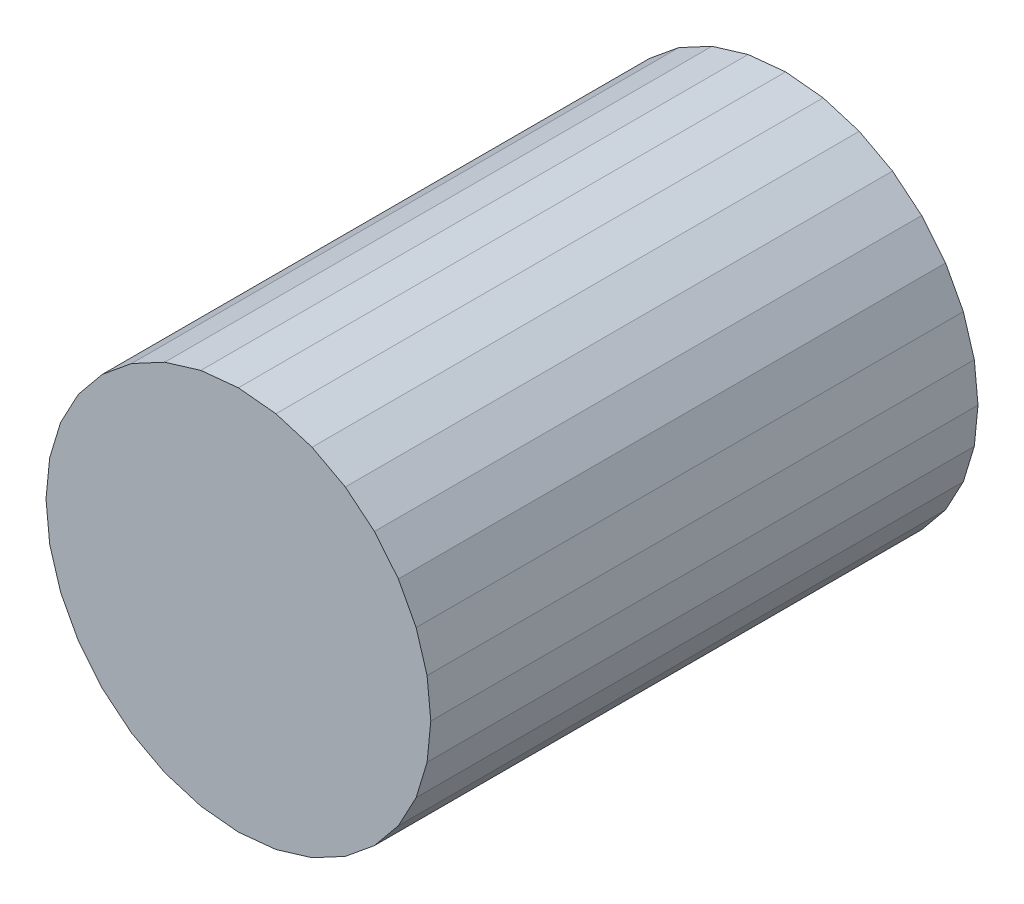
ISO-10303-21;
HEADER;
FILE_DESCRIPTION(('STEP AP214'),'2;1');
FILE_NAME('part.step','',(''),(''),'','','');
FILE_SCHEMA(('AUTOMOTIVE_DESIGN { 1 0 10303 214 1 1 1 1 }'));
ENDSEC;
DATA;
#1=APPLICATION_CONTEXT('core data for automotive mechanical design processes');
#2=APPLICATION_PROTOCOL_DEFINITION('international standard','automotive_design',2000,#1);
#3=PRODUCT_CONTEXT('',#1,'mechanical');
#4=PRODUCT('Part','Part','',(#3));
#5=PRODUCT_RELATED_PRODUCT_CATEGORY('part','',(#4));
#6=PRODUCT_DEFINITION_FORMATION('','',#4);
#7=PRODUCT_DEFINITION_CONTEXT('part definition',#1,'design');
#8=PRODUCT_DEFINITION('design','',#6,#7);
#9=PRODUCT_DEFINITION_SHAPE('','',#8);
#10=(LENGTH_UNIT() NAMED_UNIT(*) SI_UNIT(.MILLI.,.METRE.));
#11=(NAMED_UNIT(*) PLANE_ANGLE_UNIT() SI_UNIT($,.RADIAN.));
#12=(NAMED_UNIT(*) SI_UNIT($,.STERADIAN.) SOLID_ANGLE_UNIT());
#13=UNCERTAINTY_MEASURE_WITH_UNIT(LENGTH_MEASURE(1.E-05),#10,'distance_accuracy_value','');
#14=(GEOMETRIC_REPRESENTATION_CONTEXT(3) GLOBAL_UNCERTAINTY_ASSIGNED_CONTEXT((#13)) GLOBAL_UNIT_ASSIGNED_CONTEXT((#10,
#11,#12)) REPRESENTATION_CONTEXT('',''));
#15=CARTESIAN_POINT('',(0.,0.,0.));
#16=DIRECTION('',(0.,0.,1.));
#17=DIRECTION('',(1.,0.,0.));
#18=AXIS2_PLACEMENT_3D('',#15,#16,#17);
#19=CARTESIAN_POINT('',(0.,1.75795686,0.));
#20=DIRECTION('',(0.098019306513244,0.995184513319346,0.));
#21=DIRECTION('',(-0.995184513319346,0.098019306513244,0.));
#22=AXIS2_PLACEMENT_3D('',#19,#20,#21);
#23=PLANE('',#22);
#24=DIRECTION('',(0.,0.,1.));
#25=VECTOR('',#24,1.);
#26=CARTESIAN_POINT('',(0.34296096,1.7241774,0.));
#27=LINE('',#26,#25);
#28=CARTESIAN_POINT('',(0.342960959999999,1.72417739999999,0.));
#29=VERTEX_POINT('',#28);
#30=CARTESIAN_POINT('',(0.342960959999999,1.72417739999999,5.));
#31=VERTEX_POINT('',#30);
#32=EDGE_CURVE('E227',#29,#31,#27,.T.);
#33=ORIENTED_EDGE('',*,*,#32,.F.);
#34=DIRECTION('',(-0.995184513319346,0.098019306513244,0.));
#35=VECTOR('',#34,1.);
#36=CARTESIAN_POINT('',(0.,1.75795686,0.));
#37=LINE('',#36,#35);
#38=CARTESIAN_POINT('',(0.,1.75795686000001,0.));
#39=VERTEX_POINT('',#38);
#40=EDGE_CURVE('E220',#29,#39,#37,.T.);
#41=ORIENTED_EDGE('',*,*,#40,.T.);
#42=DIRECTION('',(0.,0.,1.));
#43=VECTOR('',#42,1.);
#44=CARTESIAN_POINT('',(0.,1.75795686000003,0.));
#45=LINE('',#44,#43);
#46=CARTESIAN_POINT('',(0.,1.75795686000001,5.));
#47=VERTEX_POINT('',#46);
#48=EDGE_CURVE('E230',#47,#39,#45,.F.);
#49=ORIENTED_EDGE('',*,*,#48,.F.);
#50=DIRECTION('',(-0.995184513319346,0.098019306513244,0.));
#51=VECTOR('',#50,1.);
#52=CARTESIAN_POINT('',(0.,1.75795686,5.));
#53=LINE('',#52,#51);
#54=EDGE_CURVE('E19',#47,#31,#53,.F.);
#55=ORIENTED_EDGE('',*,*,#54,.T.);
#56=EDGE_LOOP('',(#33,#41,#49,#55));
#57=FACE_BOUND('',#56,.T.);
#58=ADVANCED_FACE('F16',(#57),#23,.T.);
#59=CARTESIAN_POINT('',(0.34296096,1.7241774,0.));
#60=DIRECTION('',(0.290284564767888,0.956940369854631,0.));
#61=DIRECTION('',(-0.956940369854631,0.290284564767888,0.));
#62=AXIS2_PLACEMENT_3D('',#59,#60,#61);
#63=PLANE('',#62);
#64=DIRECTION('',(0.,0.,1.));
#65=VECTOR('',#64,1.);
#66=CARTESIAN_POINT('',(0.67274186,1.6241395,0.));
#67=LINE('',#66,#65);
#68=CARTESIAN_POINT('',(0.672741860000032,1.6241395000001,0.));
#69=VERTEX_POINT('',#68);
#70=CARTESIAN_POINT('',(0.672741860000032,1.6241395000001,5.));
#71=VERTEX_POINT('',#70);
#72=EDGE_CURVE('E251',#69,#71,#67,.T.);
#73=ORIENTED_EDGE('',*,*,#72,.F.);
#74=DIRECTION('',(-0.956940369854631,0.290284564767888,0.));
#75=VECTOR('',#74,1.);
#76=CARTESIAN_POINT('',(0.34296096,1.7241774,0.));
#77=LINE('',#76,#75);
#78=EDGE_CURVE('E240',#69,#29,#77,.T.);
#79=ORIENTED_EDGE('',*,*,#78,.T.);
#80=ORIENTED_EDGE('',*,*,#32,.T.);
#81=DIRECTION('',(-0.956940369854631,0.290284564767888,0.));
#82=VECTOR('',#81,1.);
#83=CARTESIAN_POINT('',(0.34296096,1.7241774,5.));
#84=LINE('',#83,#82);
#85=EDGE_CURVE('E233',#31,#71,#84,.F.);
#86=ORIENTED_EDGE('',*,*,#85,.T.);
#87=EDGE_LOOP('',(#73,#79,#80,#86));
#88=FACE_BOUND('',#87,.T.);
#89=ADVANCED_FACE('F242',(#88),#63,.T.);
#90=CARTESIAN_POINT('',(-0.34296096,1.7241774,0.));
#91=DIRECTION('',(-0.098019306513244,0.995184513319346,0.));
#92=DIRECTION('',(-0.995184513319346,-0.098019306513244,0.));
#93=AXIS2_PLACEMENT_3D('',#90,#91,#92);
#94=PLANE('',#93);
#95=ORIENTED_EDGE('',*,*,#48,.T.);
#96=DIRECTION('',(-0.995184513319346,-0.098019306513244,0.));
#97=VECTOR('',#96,1.);
#98=CARTESIAN_POINT('',(-0.34296096,1.7241774,0.));
#99=LINE('',#98,#97);
#100=CARTESIAN_POINT('',(-0.342960959999983,1.72417739999995,0.));
#101=VERTEX_POINT('',#100);
#102=EDGE_CURVE('E249',#39,#101,#99,.T.);
#103=ORIENTED_EDGE('',*,*,#102,.T.);
#104=DIRECTION('',(0.,0.,1.));
#105=VECTOR('',#104,1.);
#106=CARTESIAN_POINT('',(-0.342960959999937,1.72417739999979,0.));
#107=LINE('',#106,#105);
#108=CARTESIAN_POINT('',(-0.342960959999983,1.72417739999995,5.));
#109=VERTEX_POINT('',#108);
#110=EDGE_CURVE('E260',#109,#101,#107,.F.);
#111=ORIENTED_EDGE('',*,*,#110,.F.);
#112=DIRECTION('',(-0.995184513319346,-0.098019306513244,0.));
#113=VECTOR('',#112,1.);
#114=CARTESIAN_POINT('',(-0.34296096,1.7241774,5.));
#115=LINE('',#114,#113);
#116=EDGE_CURVE('E246',#109,#47,#115,.F.);
#117=ORIENTED_EDGE('',*,*,#116,.T.);
#118=EDGE_LOOP('',(#95,#103,#111,#117));
#119=FACE_BOUND('',#118,.T.);
#120=ADVANCED_FACE('F541',(#119),#94,.T.);
#121=CARTESIAN_POINT('',(0.67274186,1.6241395,0.));
#122=DIRECTION('',(0.471394074101923,0.881922687598857,0.));
#123=DIRECTION('',(-0.881922687598857,0.471394074101923,0.));
#124=AXIS2_PLACEMENT_3D('',#121,#122,#123);
#125=PLANE('',#124);
#126=DIRECTION('',(0.,0.,1.));
#127=VECTOR('',#126,1.);
#128=CARTESIAN_POINT('',(0.9766681,1.46168872,0.));
#129=LINE('',#128,#127);
#130=CARTESIAN_POINT('',(0.976668100000013,1.46168872000002,0.));
#131=VERTEX_POINT('',#130);
#132=CARTESIAN_POINT('',(0.976668100000012,1.46168872000002,5.));
#133=VERTEX_POINT('',#132);
#134=EDGE_CURVE('E265',#131,#133,#129,.T.);
#135=ORIENTED_EDGE('',*,*,#134,.F.);
#136=DIRECTION('',(-0.881922687598857,0.471394074101923,0.));
#137=VECTOR('',#136,1.);
#138=CARTESIAN_POINT('',(0.67274186,1.6241395,0.));
#139=LINE('',#138,#137);
#140=EDGE_CURVE('E254',#131,#69,#139,.T.);
#141=ORIENTED_EDGE('',*,*,#140,.T.);
#142=ORIENTED_EDGE('',*,*,#72,.T.);
#143=DIRECTION('',(-0.881922687598857,0.471394074101923,0.));
#144=VECTOR('',#143,1.);
#145=CARTESIAN_POINT('',(0.67274186,1.6241395,5.));
#146=LINE('',#145,#144);
#147=EDGE_CURVE('E236',#71,#133,#146,.F.);
#148=ORIENTED_EDGE('',*,*,#147,.T.);
#149=EDGE_LOOP('',(#135,#141,#142,#148));
#150=FACE_BOUND('',#149,.T.);
#151=ADVANCED_FACE('F538',(#150),#125,.T.);
#152=CARTESIAN_POINT('',(-0.67274186,1.6241395,0.));
#153=DIRECTION('',(-0.290284564767888,0.956940369854631,0.));
#154=DIRECTION('',(-0.956940369854631,-0.290284564767888,0.));
#155=AXIS2_PLACEMENT_3D('',#152,#153,#154);
#156=PLANE('',#155);
#157=ORIENTED_EDGE('',*,*,#110,.T.);
#158=DIRECTION('',(-0.956940369854631,-0.290284564767888,0.));
#159=VECTOR('',#158,1.);
#160=CARTESIAN_POINT('',(-0.67274186,1.6241395,0.));
#161=LINE('',#160,#159);
#162=CARTESIAN_POINT('',(-0.672741859999994,1.62413949999999,0.));
#163=VERTEX_POINT('',#162);
#164=EDGE_CURVE('E263',#101,#163,#161,.T.);
#165=ORIENTED_EDGE('',*,*,#164,.T.);
#166=DIRECTION('',(0.,0.,1.));
#167=VECTOR('',#166,1.);
#168=CARTESIAN_POINT('',(-0.672741859999975,1.62413949999995,0.));
#169=LINE('',#168,#167);
#170=CARTESIAN_POINT('',(-0.672741859999994,1.62413949999999,5.));
#171=VERTEX_POINT('',#170);
#172=EDGE_CURVE('E276',#171,#163,#169,.F.);
#173=ORIENTED_EDGE('',*,*,#172,.F.);
#174=DIRECTION('',(-0.956940369854631,-0.290284564767888,0.));
#175=VECTOR('',#174,1.);
#176=CARTESIAN_POINT('',(-0.67274186,1.6241395,5.));
#177=LINE('',#176,#175);
#178=EDGE_CURVE('E257',#171,#109,#177,.F.);
#179=ORIENTED_EDGE('',*,*,#178,.T.);
#180=EDGE_LOOP('',(#157,#165,#173,#179));
#181=FACE_BOUND('',#180,.T.);
#182=ADVANCED_FACE('F540',(#181),#156,.T.);
#183=CARTESIAN_POINT('',(0.9766681,1.46168872,0.));
#184=DIRECTION('',(0.63439420206869,0.773009700056623,0.));
#185=DIRECTION('',(-0.773009700056623,0.63439420206869,0.));
#186=AXIS2_PLACEMENT_3D('',#183,#184,#185);
#187=PLANE('',#186);
#188=DIRECTION('',(0.,0.,1.));
#189=VECTOR('',#188,1.);
#190=CARTESIAN_POINT('',(1.2430633,1.2430633,0.));
#191=LINE('',#190,#189);
#192=CARTESIAN_POINT('',(1.24306330000001,1.24306330000001,0.));
#193=VERTEX_POINT('',#192);
#194=CARTESIAN_POINT('',(1.24306330000001,1.24306330000001,5.));
#195=VERTEX_POINT('',#194);
#196=EDGE_CURVE('E281',#193,#195,#191,.T.);
#197=ORIENTED_EDGE('',*,*,#196,.F.);
#198=DIRECTION('',(-0.773009700056623,0.63439420206869,0.));
#199=VECTOR('',#198,1.);
#200=CARTESIAN_POINT('',(0.9766681,1.46168872,0.));
#201=LINE('',#200,#199);
#202=EDGE_CURVE('E270',#193,#131,#201,.T.);
#203=ORIENTED_EDGE('',*,*,#202,.T.);
#204=ORIENTED_EDGE('',*,*,#134,.T.);
#205=DIRECTION('',(-0.773009700056623,0.63439420206869,0.));
#206=VECTOR('',#205,1.);
#207=CARTESIAN_POINT('',(0.9766681,1.46168872,5.));
#208=LINE('',#207,#206);
#209=EDGE_CURVE('E268',#133,#195,#208,.F.);
#210=ORIENTED_EDGE('',*,*,#209,.T.);
#211=EDGE_LOOP('',(#197,#203,#204,#210));
#212=FACE_BOUND('',#211,.T.);
#213=ADVANCED_FACE('F535',(#212),#187,.T.);
#214=CARTESIAN_POINT('',(-0.9766681,1.46168872,0.));
#215=DIRECTION('',(-0.471394074101923,0.881922687598857,0.));
#216=DIRECTION('',(-0.881922687598857,-0.471394074101923,0.));
#217=AXIS2_PLACEMENT_3D('',#214,#215,#216);
#218=PLANE('',#217);
#219=ORIENTED_EDGE('',*,*,#172,.T.);
#220=DIRECTION('',(-0.881922687598857,-0.471394074101923,0.));
#221=VECTOR('',#220,1.);
#222=CARTESIAN_POINT('',(-0.9766681,1.46168872,0.));
#223=LINE('',#222,#221);
#224=CARTESIAN_POINT('',(-0.976668099999996,1.46168872,0.));
#225=VERTEX_POINT('',#224);
#226=EDGE_CURVE('E279',#163,#225,#223,.T.);
#227=ORIENTED_EDGE('',*,*,#226,.T.);
#228=DIRECTION('',(0.,0.,1.));
#229=VECTOR('',#228,1.);
#230=CARTESIAN_POINT('',(-0.976668099999985,1.46168871999998,0.));
#231=LINE('',#230,#229);
#232=CARTESIAN_POINT('',(-0.976668099999996,1.46168872,5.));
#233=VERTEX_POINT('',#232);
#234=EDGE_CURVE('E292',#233,#225,#231,.F.);
#235=ORIENTED_EDGE('',*,*,#234,.F.);
#236=DIRECTION('',(-0.881922687598857,-0.471394074101923,0.));
#237=VECTOR('',#236,1.);
#238=CARTESIAN_POINT('',(-0.9766681,1.46168872,5.));
#239=LINE('',#238,#237);
#240=EDGE_CURVE('E273',#233,#171,#239,.F.);
#241=ORIENTED_EDGE('',*,*,#240,.T.);
#242=EDGE_LOOP('',(#219,#227,#235,#241));
#243=FACE_BOUND('',#242,.T.);
#244=ADVANCED_FACE('F633',(#243),#218,.T.);
#245=CARTESIAN_POINT('',(1.2430633,1.2430633,0.));
#246=DIRECTION('',(0.773009700056623,0.63439420206869,0.));
#247=DIRECTION('',(-0.63439420206869,0.773009700056623,0.));
#248=AXIS2_PLACEMENT_3D('',#245,#246,#247);
#249=PLANE('',#248);
#250=DIRECTION('',(0.,0.,1.));
#251=VECTOR('',#250,1.);
#252=CARTESIAN_POINT('',(1.46168872,0.9766681,0.));
#253=LINE('',#252,#251);
#254=CARTESIAN_POINT('',(1.46168871999999,0.976668099999992,0.));
#255=VERTEX_POINT('',#254);
#256=CARTESIAN_POINT('',(1.46168871999999,0.976668099999992,5.));
#257=VERTEX_POINT('',#256);
#258=EDGE_CURVE('E297',#255,#257,#253,.T.);
#259=ORIENTED_EDGE('',*,*,#258,.F.);
#260=DIRECTION('',(-0.63439420206869,0.773009700056623,0.));
#261=VECTOR('',#260,1.);
#262=CARTESIAN_POINT('',(1.2430633,1.2430633,0.));
#263=LINE('',#262,#261);
#264=EDGE_CURVE('E286',#255,#193,#263,.T.);
#265=ORIENTED_EDGE('',*,*,#264,.T.);
#266=ORIENTED_EDGE('',*,*,#196,.T.);
#267=DIRECTION('',(-0.63439420206869,0.773009700056623,0.));
#268=VECTOR('',#267,1.);
#269=CARTESIAN_POINT('',(1.2430633,1.2430633,5.));
#270=LINE('',#269,#268);
#271=EDGE_CURVE('E284',#195,#257,#270,.F.);
#272=ORIENTED_EDGE('',*,*,#271,.T.);
#273=EDGE_LOOP('',(#259,#265,#266,#272));
#274=FACE_BOUND('',#273,.T.);
#275=ADVANCED_FACE('F532',(#274),#249,.T.);
#276=CARTESIAN_POINT('',(-1.2430633,1.2430633,0.));
#277=DIRECTION('',(-0.63439420206869,0.773009700056623,0.));
#278=DIRECTION('',(-0.773009700056623,-0.63439420206869,0.));
#279=AXIS2_PLACEMENT_3D('',#276,#277,#278);
#280=PLANE('',#279);
#281=ORIENTED_EDGE('',*,*,#234,.T.);
#282=DIRECTION('',(-0.773009700056623,-0.63439420206869,0.));
#283=VECTOR('',#282,1.);
#284=CARTESIAN_POINT('',(-1.2430633,1.2430633,0.));
#285=LINE('',#284,#283);
#286=CARTESIAN_POINT('',(-1.2430633,1.2430633,0.));
#287=VERTEX_POINT('',#286);
#288=EDGE_CURVE('E295',#225,#287,#285,.T.);
#289=ORIENTED_EDGE('',*,*,#288,.T.);
#290=DIRECTION('',(0.,0.,1.));
#291=VECTOR('',#290,1.);
#292=CARTESIAN_POINT('',(-1.24306330000002,1.24306330000002,0.));
#293=LINE('',#292,#291);
#294=CARTESIAN_POINT('',(-1.2430633,1.2430633,5.));
#295=VERTEX_POINT('',#294);
#296=EDGE_CURVE('E308',#295,#287,#293,.F.);
#297=ORIENTED_EDGE('',*,*,#296,.F.);
#298=DIRECTION('',(-0.773009700056623,-0.63439420206869,0.));
#299=VECTOR('',#298,1.);
#300=CARTESIAN_POINT('',(-1.2430633,1.2430633,5.));
#301=LINE('',#300,#299);
#302=EDGE_CURVE('E289',#295,#233,#301,.F.);
#303=ORIENTED_EDGE('',*,*,#302,.T.);
#304=EDGE_LOOP('',(#281,#289,#297,#303));
#305=FACE_BOUND('',#304,.T.);
#306=ADVANCED_FACE('F627',(#305),#280,.T.);
#307=CARTESIAN_POINT('',(1.46168872,0.9766681,0.));
#308=DIRECTION('',(0.881922687598857,0.471394074101923,0.));
#309=DIRECTION('',(-0.471394074101923,0.881922687598857,0.));
#310=AXIS2_PLACEMENT_3D('',#307,#308,#309);
#311=PLANE('',#310);
#312=DIRECTION('',(0.,0.,1.));
#313=VECTOR('',#312,1.);
#314=CARTESIAN_POINT('',(1.6241395,0.67274186,0.));
#315=LINE('',#314,#313);
#316=CARTESIAN_POINT('',(1.62413949999998,0.672741859999988,0.));
#317=VERTEX_POINT('',#316);
#318=CARTESIAN_POINT('',(1.62413949999998,0.672741859999988,5.));
#319=VERTEX_POINT('',#318);
#320=EDGE_CURVE('E313',#317,#319,#315,.T.);
#321=ORIENTED_EDGE('',*,*,#320,.F.);
#322=DIRECTION('',(-0.471394074101923,0.881922687598857,0.));
#323=VECTOR('',#322,1.);
#324=CARTESIAN_POINT('',(1.46168872,0.9766681,0.));
#325=LINE('',#324,#323);
#326=EDGE_CURVE('E302',#317,#255,#325,.T.);
#327=ORIENTED_EDGE('',*,*,#326,.T.);
#328=ORIENTED_EDGE('',*,*,#258,.T.);
#329=DIRECTION('',(-0.471394074101923,0.881922687598857,0.));
#330=VECTOR('',#329,1.);
#331=CARTESIAN_POINT('',(1.46168872,0.9766681,5.));
#332=LINE('',#331,#330);
#333=EDGE_CURVE('E300',#257,#319,#332,.F.);
#334=ORIENTED_EDGE('',*,*,#333,.T.);
#335=EDGE_LOOP('',(#321,#327,#328,#334));
#336=FACE_BOUND('',#335,.T.);
#337=ADVANCED_FACE('F530',(#336),#311,.T.);
#338=CARTESIAN_POINT('',(-1.46168872,0.9766681,0.));
#339=DIRECTION('',(-0.773009700056623,0.63439420206869,0.));
#340=DIRECTION('',(-0.63439420206869,-0.773009700056623,0.));
#341=AXIS2_PLACEMENT_3D('',#338,#339,#340);
#342=PLANE('',#341);
#343=ORIENTED_EDGE('',*,*,#296,.T.);
#344=DIRECTION('',(-0.63439420206869,-0.773009700056623,0.));
#345=VECTOR('',#344,1.);
#346=CARTESIAN_POINT('',(-1.46168872,0.9766681,0.));
#347=LINE('',#346,#345);
#348=CARTESIAN_POINT('',(-1.46168872000001,0.976668100000006,0.));
#349=VERTEX_POINT('',#348);
#350=EDGE_CURVE('E311',#287,#349,#347,.T.);
#351=ORIENTED_EDGE('',*,*,#350,.T.);
#352=DIRECTION('',(0.,0.,1.));
#353=VECTOR('',#352,1.);
#354=CARTESIAN_POINT('',(-1.46168872000005,0.976668100000024,0.));
#355=LINE('',#354,#353);
#356=CARTESIAN_POINT('',(-1.46168872000001,0.976668100000007,5.));
#357=VERTEX_POINT('',#356);
#358=EDGE_CURVE('E324',#357,#349,#355,.F.);
#359=ORIENTED_EDGE('',*,*,#358,.F.);
#360=DIRECTION('',(-0.63439420206869,-0.773009700056623,0.));
#361=VECTOR('',#360,1.);
#362=CARTESIAN_POINT('',(-1.46168872,0.9766681,5.));
#363=LINE('',#362,#361);
#364=EDGE_CURVE('E305',#357,#295,#363,.F.);
#365=ORIENTED_EDGE('',*,*,#364,.T.);
#366=EDGE_LOOP('',(#343,#351,#359,#365));
#367=FACE_BOUND('',#366,.T.);
#368=ADVANCED_FACE('F621',(#367),#342,.T.);
#369=CARTESIAN_POINT('',(1.6241395,0.67274186,0.));
#370=DIRECTION('',(0.956940369854631,0.290284564767888,0.));
#371=DIRECTION('',(-0.290284564767888,0.956940369854631,0.));
#372=AXIS2_PLACEMENT_3D('',#369,#370,#371);
#373=PLANE('',#372);
#374=DIRECTION('',(0.,0.,1.));
#375=VECTOR('',#374,1.);
#376=CARTESIAN_POINT('',(1.7241774,0.34296096,0.));
#377=LINE('',#376,#375);
#378=CARTESIAN_POINT('',(1.7241773999999,0.342960959999969,0.));
#379=VERTEX_POINT('',#378);
#380=CARTESIAN_POINT('',(1.7241773999999,0.342960959999969,5.));
#381=VERTEX_POINT('',#380);
#382=EDGE_CURVE('E329',#379,#381,#377,.T.);
#383=ORIENTED_EDGE('',*,*,#382,.F.);
#384=DIRECTION('',(-0.290284564767888,0.956940369854631,0.));
#385=VECTOR('',#384,1.);
#386=CARTESIAN_POINT('',(1.6241395,0.67274186,0.));
#387=LINE('',#386,#385);
#388=EDGE_CURVE('E318',#379,#317,#387,.T.);
#389=ORIENTED_EDGE('',*,*,#388,.T.);
#390=ORIENTED_EDGE('',*,*,#320,.T.);
#391=DIRECTION('',(-0.290284564767888,0.956940369854631,0.));
#392=VECTOR('',#391,1.);
#393=CARTESIAN_POINT('',(1.6241395,0.67274186,5.));
#394=LINE('',#393,#392);
#395=EDGE_CURVE('E316',#319,#381,#394,.F.);
#396=ORIENTED_EDGE('',*,*,#395,.T.);
#397=EDGE_LOOP('',(#383,#389,#390,#396));
#398=FACE_BOUND('',#397,.T.);
#399=ADVANCED_FACE('F524',(#398),#373,.T.);
#400=CARTESIAN_POINT('',(-1.6241395,0.67274186,0.));
#401=DIRECTION('',(-0.881922687598857,0.471394074101923,0.));
#402=DIRECTION('',(-0.471394074101923,-0.881922687598857,0.));
#403=AXIS2_PLACEMENT_3D('',#400,#401,#402);
#404=PLANE('',#403);
#405=ORIENTED_EDGE('',*,*,#358,.T.);
#406=DIRECTION('',(-0.471394074101923,-0.881922687598857,0.));
#407=VECTOR('',#406,1.);
#408=CARTESIAN_POINT('',(-1.6241395,0.67274186,0.));
#409=LINE('',#408,#407);
#410=CARTESIAN_POINT('',(-1.62413949999995,0.672741859999984,0.));
#411=VERTEX_POINT('',#410);
#412=EDGE_CURVE('E327',#349,#411,#409,.T.);
#413=ORIENTED_EDGE('',*,*,#412,.T.);
#414=DIRECTION('',(0.,0.,1.));
#415=VECTOR('',#414,1.);
#416=CARTESIAN_POINT('',(-1.6241394999998,0.672741859999939,0.));
#417=LINE('',#416,#415);
#418=CARTESIAN_POINT('',(-1.62413949999995,0.672741859999983,5.));
#419=VERTEX_POINT('',#418);
#420=EDGE_CURVE('E340',#419,#411,#417,.F.);
#421=ORIENTED_EDGE('',*,*,#420,.F.);
#422=DIRECTION('',(-0.471394074101923,-0.881922687598857,0.));
#423=VECTOR('',#422,1.);
#424=CARTESIAN_POINT('',(-1.6241395,0.67274186,5.));
#425=LINE('',#424,#423);
#426=EDGE_CURVE('E321',#419,#357,#425,.F.);
#427=ORIENTED_EDGE('',*,*,#426,.T.);
#428=EDGE_LOOP('',(#405,#413,#421,#427));
#429=FACE_BOUND('',#428,.T.);
#430=ADVANCED_FACE('F615',(#429),#404,.T.);
#431=CARTESIAN_POINT('',(1.7241774,0.34296096,0.));
#432=DIRECTION('',(0.995184513319346,0.098019306513244,0.));
#433=DIRECTION('',(-0.098019306513244,0.995184513319346,0.));
#434=AXIS2_PLACEMENT_3D('',#431,#432,#433);
#435=PLANE('',#434);
#436=DIRECTION('',(0.,0.,1.));
#437=VECTOR('',#436,1.);
#438=CARTESIAN_POINT('',(1.75795686,0.,0.));
#439=LINE('',#438,#437);
#440=CARTESIAN_POINT('',(1.75795686000001,0.,0.));
#441=VERTEX_POINT('',#440);
#442=CARTESIAN_POINT('',(1.75795686000001,0.,5.));
#443=VERTEX_POINT('',#442);
#444=EDGE_CURVE('E345',#441,#443,#439,.T.);
#445=ORIENTED_EDGE('',*,*,#444,.F.);
#446=DIRECTION('',(-0.098019306513244,0.995184513319346,0.));
#447=VECTOR('',#446,1.);
#448=CARTESIAN_POINT('',(1.7241774,0.34296096,0.));
#449=LINE('',#448,#447);
#450=EDGE_CURVE('E334',#441,#379,#449,.T.);
#451=ORIENTED_EDGE('',*,*,#450,.T.);
#452=ORIENTED_EDGE('',*,*,#382,.T.);
#453=DIRECTION('',(-0.098019306513244,0.995184513319346,0.));
#454=VECTOR('',#453,1.);
#455=CARTESIAN_POINT('',(1.7241774,0.34296096,5.));
#456=LINE('',#455,#454);
#457=EDGE_CURVE('E332',#381,#443,#456,.F.);
#458=ORIENTED_EDGE('',*,*,#457,.T.);
#459=EDGE_LOOP('',(#445,#451,#452,#458));
#460=FACE_BOUND('',#459,.T.);
#461=ADVANCED_FACE('F521',(#460),#435,.T.);
#462=CARTESIAN_POINT('',(-1.7241774,0.34296096,0.));
#463=DIRECTION('',(-0.956940369854269,0.290284564769082,0.));
#464=DIRECTION('',(-0.290284564769082,-0.956940369854269,0.));
#465=AXIS2_PLACEMENT_3D('',#462,#463,#464);
#466=PLANE('',#465);
#467=ORIENTED_EDGE('',*,*,#420,.T.);
#468=DIRECTION('',(-0.290284564769082,-0.956940369854269,0.));
#469=VECTOR('',#468,1.);
#470=CARTESIAN_POINT('',(-1.7241774,0.34296096,0.));
#471=LINE('',#470,#469);
#472=CARTESIAN_POINT('',(-1.72417739999999,0.342960959999999,0.));
#473=VERTEX_POINT('',#472);
#474=EDGE_CURVE('E343',#411,#473,#471,.T.);
#475=ORIENTED_EDGE('',*,*,#474,.T.);
#476=DIRECTION('',(0.,0.,1.));
#477=VECTOR('',#476,1.);
#478=CARTESIAN_POINT('',(-1.72417739999997,0.342960959999997,0.));
#479=LINE('',#478,#477);
#480=CARTESIAN_POINT('',(-1.72417739999999,0.342960959999999,5.));
#481=VERTEX_POINT('',#480);
#482=EDGE_CURVE('E356',#481,#473,#479,.F.);
#483=ORIENTED_EDGE('',*,*,#482,.F.);
#484=DIRECTION('',(-0.290284564769082,-0.956940369854269,0.));
#485=VECTOR('',#484,1.);
#486=CARTESIAN_POINT('',(-1.7241774,0.34296096,5.));
#487=LINE('',#486,#485);
#488=EDGE_CURVE('E337',#481,#419,#487,.F.);
#489=ORIENTED_EDGE('',*,*,#488,.T.);
#490=EDGE_LOOP('',(#467,#475,#483,#489));
#491=FACE_BOUND('',#490,.T.);
#492=ADVANCED_FACE('F609',(#491),#466,.T.);
#493=CARTESIAN_POINT('',(1.75795686,0.,0.));
#494=DIRECTION('',(0.995184513319346,-0.098019306513244,0.));
#495=DIRECTION('',(0.098019306513244,0.995184513319346,0.));
#496=AXIS2_PLACEMENT_3D('',#493,#494,#495);
#497=PLANE('',#496);
#498=DIRECTION('',(0.,0.,1.));
#499=VECTOR('',#498,1.);
#500=CARTESIAN_POINT('',(1.7241774,-0.34296096,0.));
#501=LINE('',#500,#499);
#502=CARTESIAN_POINT('',(1.72417739999999,-0.342960959999999,0.));
#503=VERTEX_POINT('',#502);
#504=CARTESIAN_POINT('',(1.72417739999999,-0.342960959999999,5.));
#505=VERTEX_POINT('',#504);
#506=EDGE_CURVE('E361',#503,#505,#501,.T.);
#507=ORIENTED_EDGE('',*,*,#506,.F.);
#508=DIRECTION('',(0.098019306513244,0.995184513319346,0.));
#509=VECTOR('',#508,1.);
#510=CARTESIAN_POINT('',(1.75795686,0.,0.));
#511=LINE('',#510,#509);
#512=EDGE_CURVE('E350',#503,#441,#511,.T.);
#513=ORIENTED_EDGE('',*,*,#512,.T.);
#514=ORIENTED_EDGE('',*,*,#444,.T.);
#515=DIRECTION('',(0.098019306513244,0.995184513319346,0.));
#516=VECTOR('',#515,1.);
#517=CARTESIAN_POINT('',(1.75795686,0.,5.));
#518=LINE('',#517,#516);
#519=EDGE_CURVE('E348',#443,#505,#518,.F.);
#520=ORIENTED_EDGE('',*,*,#519,.T.);
#521=EDGE_LOOP('',(#507,#513,#514,#520));
#522=FACE_BOUND('',#521,.T.);
#523=ADVANCED_FACE('F519',(#522),#497,.T.);
#524=CARTESIAN_POINT('',(-1.75795686,0.,0.));
#525=DIRECTION('',(-0.995184513319346,0.098019306513244,0.));
#526=DIRECTION('',(-0.098019306513244,-0.995184513319346,0.));
#527=AXIS2_PLACEMENT_3D('',#524,#525,#526);
#528=PLANE('',#527);
#529=ORIENTED_EDGE('',*,*,#482,.T.);
#530=DIRECTION('',(-0.098019306513244,-0.995184513319346,0.));
#531=VECTOR('',#530,1.);
#532=CARTESIAN_POINT('',(-1.75795686,0.,0.));
#533=LINE('',#532,#531);
#534=CARTESIAN_POINT('',(-1.75795686000001,0.,0.));
#535=VERTEX_POINT('',#534);
#536=EDGE_CURVE('E359',#473,#535,#533,.T.);
#537=ORIENTED_EDGE('',*,*,#536,.T.);
#538=DIRECTION('',(0.,0.,1.));
#539=VECTOR('',#538,1.);
#540=CARTESIAN_POINT('',(-1.75795686000003,0.,0.));
#541=LINE('',#540,#539);
#542=CARTESIAN_POINT('',(-1.75795686000001,0.,5.));
#543=VERTEX_POINT('',#542);
#544=EDGE_CURVE('E372',#543,#535,#541,.F.);
#545=ORIENTED_EDGE('',*,*,#544,.F.);
#546=DIRECTION('',(-0.098019306513244,-0.995184513319346,0.));
#547=VECTOR('',#546,1.);
#548=CARTESIAN_POINT('',(-1.75795686,0.,5.));
#549=LINE('',#548,#547);
#550=EDGE_CURVE('E353',#543,#481,#549,.F.);
#551=ORIENTED_EDGE('',*,*,#550,.T.);
#552=EDGE_LOOP('',(#529,#537,#545,#551));
#553=FACE_BOUND('',#552,.T.);
#554=ADVANCED_FACE('F603',(#553),#528,.T.);
#555=CARTESIAN_POINT('',(1.7241774,-0.34296096,0.));
#556=DIRECTION('',(0.956940369854631,-0.290284564767888,0.));
#557=DIRECTION('',(0.290284564767888,0.956940369854631,0.));
#558=AXIS2_PLACEMENT_3D('',#555,#556,#557);
#559=PLANE('',#558);
#560=DIRECTION('',(0.,0.,1.));
#561=VECTOR('',#560,1.);
#562=CARTESIAN_POINT('',(1.6241395,-0.67274186,0.));
#563=LINE('',#562,#561);
#564=CARTESIAN_POINT('',(1.6241395000001,-0.672741860000031,0.));
#565=VERTEX_POINT('',#564);
#566=CARTESIAN_POINT('',(1.6241395000001,-0.672741860000031,5.));
#567=VERTEX_POINT('',#566);
#568=EDGE_CURVE('E377',#565,#567,#563,.T.);
#569=ORIENTED_EDGE('',*,*,#568,.F.);
#570=DIRECTION('',(0.290284564767888,0.956940369854631,0.));
#571=VECTOR('',#570,1.);
#572=CARTESIAN_POINT('',(1.7241774,-0.34296096,0.));
#573=LINE('',#572,#571);
#574=EDGE_CURVE('E366',#565,#503,#573,.T.);
#575=ORIENTED_EDGE('',*,*,#574,.T.);
#576=ORIENTED_EDGE('',*,*,#506,.T.);
#577=DIRECTION('',(0.290284564767888,0.956940369854631,0.));
#578=VECTOR('',#577,1.);
#579=CARTESIAN_POINT('',(1.7241774,-0.34296096,5.));
#580=LINE('',#579,#578);
#581=EDGE_CURVE('E364',#505,#567,#580,.F.);
#582=ORIENTED_EDGE('',*,*,#581,.T.);
#583=EDGE_LOOP('',(#569,#575,#576,#582));
#584=FACE_BOUND('',#583,.T.);
#585=ADVANCED_FACE('F512',(#584),#559,.T.);
#586=CARTESIAN_POINT('',(-1.7241774,-0.34296096,0.));
#587=DIRECTION('',(-0.995184513319346,-0.098019306513244,0.));
#588=DIRECTION('',(0.098019306513244,-0.995184513319346,0.));
#589=AXIS2_PLACEMENT_3D('',#586,#587,#588);
#590=PLANE('',#589);
#591=ORIENTED_EDGE('',*,*,#544,.T.);
#592=DIRECTION('',(0.098019306513244,-0.995184513319346,0.));
#593=VECTOR('',#592,1.);
#594=CARTESIAN_POINT('',(-1.7241774,-0.34296096,0.));
#595=LINE('',#594,#593);
#596=CARTESIAN_POINT('',(-1.72417740000005,-0.342960960000016,0.));
#597=VERTEX_POINT('',#596);
#598=EDGE_CURVE('E375',#535,#597,#595,.T.);
#599=ORIENTED_EDGE('',*,*,#598,.T.);
#600=DIRECTION('',(0.,0.,1.));
#601=VECTOR('',#600,1.);
#602=CARTESIAN_POINT('',(-1.7241774000002,-0.342960960000061,0.));
#603=LINE('',#602,#601);
#604=CARTESIAN_POINT('',(-1.72417740000005,-0.342960960000017,5.));
#605=VERTEX_POINT('',#604);
#606=EDGE_CURVE('E388',#605,#597,#603,.F.);
#607=ORIENTED_EDGE('',*,*,#606,.F.);
#608=DIRECTION('',(0.098019306513244,-0.995184513319346,0.));
#609=VECTOR('',#608,1.);
#610=CARTESIAN_POINT('',(-1.7241774,-0.34296096,5.));
#611=LINE('',#610,#609);
#612=EDGE_CURVE('E369',#605,#543,#611,.F.);
#613=ORIENTED_EDGE('',*,*,#612,.T.);
#614=EDGE_LOOP('',(#591,#599,#607,#613));
#615=FACE_BOUND('',#614,.T.);
#616=ADVANCED_FACE('F597',(#615),#590,.T.);
#617=CARTESIAN_POINT('',(1.6241395,-0.67274186,0.));
#618=DIRECTION('',(0.881922687598857,-0.471394074101923,0.));
#619=DIRECTION('',(0.471394074101923,0.881922687598857,0.));
#620=AXIS2_PLACEMENT_3D('',#617,#618,#619);
#621=PLANE('',#620);
#622=DIRECTION('',(0.,0.,1.));
#623=VECTOR('',#622,1.);
#624=CARTESIAN_POINT('',(1.46168872,-0.9766681,0.));
#625=LINE('',#624,#623);
#626=CARTESIAN_POINT('',(1.46168872000002,-0.976668100000012,0.));
#627=VERTEX_POINT('',#626);
#628=CARTESIAN_POINT('',(1.46168872000002,-0.976668100000012,5.));
#629=VERTEX_POINT('',#628);
#630=EDGE_CURVE('E393',#627,#629,#625,.T.);
#631=ORIENTED_EDGE('',*,*,#630,.F.);
#632=DIRECTION('',(0.471394074101923,0.881922687598857,0.));
#633=VECTOR('',#632,1.);
#634=CARTESIAN_POINT('',(1.6241395,-0.67274186,0.));
#635=LINE('',#634,#633);
#636=EDGE_CURVE('E382',#627,#565,#635,.T.);
#637=ORIENTED_EDGE('',*,*,#636,.T.);
#638=ORIENTED_EDGE('',*,*,#568,.T.);
#639=DIRECTION('',(0.471394074101923,0.881922687598857,0.));
#640=VECTOR('',#639,1.);
#641=CARTESIAN_POINT('',(1.6241395,-0.67274186,5.));
#642=LINE('',#641,#640);
#643=EDGE_CURVE('E380',#567,#629,#642,.F.);
#644=ORIENTED_EDGE('',*,*,#643,.T.);
#645=EDGE_LOOP('',(#631,#637,#638,#644));
#646=FACE_BOUND('',#645,.T.);
#647=ADVANCED_FACE('F509',(#646),#621,.T.);
#648=CARTESIAN_POINT('',(-1.6241395,-0.67274186,0.));
#649=DIRECTION('',(-0.956940369854269,-0.290284564769082,0.));
#650=DIRECTION('',(0.290284564769082,-0.956940369854269,0.));
#651=AXIS2_PLACEMENT_3D('',#648,#649,#650);
#652=PLANE('',#651);
#653=ORIENTED_EDGE('',*,*,#606,.T.);
#654=DIRECTION('',(0.290284564769082,-0.956940369854269,0.));
#655=VECTOR('',#654,1.);
#656=CARTESIAN_POINT('',(-1.6241395,-0.67274186,0.));
#657=LINE('',#656,#655);
#658=CARTESIAN_POINT('',(-1.62413949999999,-0.672741859999994,0.));
#659=VERTEX_POINT('',#658);
#660=EDGE_CURVE('E391',#597,#659,#657,.T.);
#661=ORIENTED_EDGE('',*,*,#660,.T.);
#662=DIRECTION('',(0.,0.,1.));
#663=VECTOR('',#662,1.);
#664=CARTESIAN_POINT('',(-1.62413949999995,-0.672741859999975,0.));
#665=LINE('',#664,#663);
#666=CARTESIAN_POINT('',(-1.62413949999999,-0.672741859999994,5.));
#667=VERTEX_POINT('',#666);
#668=EDGE_CURVE('E404',#667,#659,#665,.F.);
#669=ORIENTED_EDGE('',*,*,#668,.F.);
#670=DIRECTION('',(0.290284564769082,-0.956940369854269,0.));
#671=VECTOR('',#670,1.);
#672=CARTESIAN_POINT('',(-1.6241395,-0.67274186,5.));
#673=LINE('',#672,#671);
#674=EDGE_CURVE('E385',#667,#605,#673,.F.);
#675=ORIENTED_EDGE('',*,*,#674,.T.);
#676=EDGE_LOOP('',(#653,#661,#669,#675));
#677=FACE_BOUND('',#676,.T.);
#678=ADVANCED_FACE('F591',(#677),#652,.T.);
#679=CARTESIAN_POINT('',(1.46168872,-0.9766681,0.));
#680=DIRECTION('',(0.773009700056623,-0.63439420206869,0.));
#681=DIRECTION('',(0.63439420206869,0.773009700056623,0.));
#682=AXIS2_PLACEMENT_3D('',#679,#680,#681);
#683=PLANE('',#682);
#684=DIRECTION('',(0.,0.,1.));
#685=VECTOR('',#684,1.);
#686=CARTESIAN_POINT('',(1.2430633,-1.2430633,0.));
#687=LINE('',#686,#685);
#688=CARTESIAN_POINT('',(1.24306330000001,-1.24306330000001,0.));
#689=VERTEX_POINT('',#688);
#690=CARTESIAN_POINT('',(1.24306330000001,-1.24306330000001,5.));
#691=VERTEX_POINT('',#690);
#692=EDGE_CURVE('E409',#689,#691,#687,.T.);
#693=ORIENTED_EDGE('',*,*,#692,.F.);
#694=DIRECTION('',(0.63439420206869,0.773009700056623,0.));
#695=VECTOR('',#694,1.);
#696=CARTESIAN_POINT('',(1.46168872,-0.9766681,0.));
#697=LINE('',#696,#695);
#698=EDGE_CURVE('E398',#689,#627,#697,.T.);
#699=ORIENTED_EDGE('',*,*,#698,.T.);
#700=ORIENTED_EDGE('',*,*,#630,.T.);
#701=DIRECTION('',(0.63439420206869,0.773009700056623,0.));
#702=VECTOR('',#701,1.);
#703=CARTESIAN_POINT('',(1.46168872,-0.9766681,5.));
#704=LINE('',#703,#702);
#705=EDGE_CURVE('E396',#629,#691,#704,.F.);
#706=ORIENTED_EDGE('',*,*,#705,.T.);
#707=EDGE_LOOP('',(#693,#699,#700,#706));
#708=FACE_BOUND('',#707,.T.);
#709=ADVANCED_FACE('F507',(#708),#683,.T.);
#710=CARTESIAN_POINT('',(-1.46168872,-0.9766681,0.));
#711=DIRECTION('',(-0.881922687598857,-0.471394074101923,0.));
#712=DIRECTION('',(0.471394074101923,-0.881922687598857,0.));
#713=AXIS2_PLACEMENT_3D('',#710,#711,#712);
#714=PLANE('',#713);
#715=ORIENTED_EDGE('',*,*,#668,.T.);
#716=DIRECTION('',(0.471394074101923,-0.881922687598857,0.));
#717=VECTOR('',#716,1.);
#718=CARTESIAN_POINT('',(-1.46168872,-0.9766681,0.));
#719=LINE('',#718,#717);
#720=CARTESIAN_POINT('',(-1.46168872,-0.976668099999996,0.));
#721=VERTEX_POINT('',#720);
#722=EDGE_CURVE('E407',#659,#721,#719,.T.);
#723=ORIENTED_EDGE('',*,*,#722,.T.);
#724=DIRECTION('',(0.,0.,1.));
#725=VECTOR('',#724,1.);
#726=CARTESIAN_POINT('',(-1.46168871999998,-0.976668099999985,0.));
#727=LINE('',#726,#725);
#728=CARTESIAN_POINT('',(-1.46168872,-0.976668099999995,5.));
#729=VERTEX_POINT('',#728);
#730=EDGE_CURVE('E420',#729,#721,#727,.F.);
#731=ORIENTED_EDGE('',*,*,#730,.F.);
#732=DIRECTION('',(0.471394074101923,-0.881922687598857,0.));
#733=VECTOR('',#732,1.);
#734=CARTESIAN_POINT('',(-1.46168872,-0.9766681,5.));
#735=LINE('',#734,#733);
#736=EDGE_CURVE('E401',#729,#667,#735,.F.);
#737=ORIENTED_EDGE('',*,*,#736,.T.);
#738=EDGE_LOOP('',(#715,#723,#731,#737));
#739=FACE_BOUND('',#738,.T.);
#740=ADVANCED_FACE('F585',(#739),#714,.T.);
#741=CARTESIAN_POINT('',(1.2430633,-1.2430633,0.));
#742=DIRECTION('',(0.63439420206869,-0.773009700056623,0.));
#743=DIRECTION('',(0.773009700056623,0.63439420206869,0.));
#744=AXIS2_PLACEMENT_3D('',#741,#742,#743);
#745=PLANE('',#744);
#746=DIRECTION('',(0.,0.,1.));
#747=VECTOR('',#746,1.);
#748=CARTESIAN_POINT('',(0.9766681,-1.46168872,0.));
#749=LINE('',#748,#747);
#750=CARTESIAN_POINT('',(0.976668099999992,-1.46168871999999,0.));
#751=VERTEX_POINT('',#750);
#752=CARTESIAN_POINT('',(0.976668099999992,-1.46168871999999,5.));
#753=VERTEX_POINT('',#752);
#754=EDGE_CURVE('E425',#751,#753,#749,.T.);
#755=ORIENTED_EDGE('',*,*,#754,.F.);
#756=DIRECTION('',(0.773009700056623,0.63439420206869,0.));
#757=VECTOR('',#756,1.);
#758=CARTESIAN_POINT('',(1.2430633,-1.2430633,0.));
#759=LINE('',#758,#757);
#760=EDGE_CURVE('E414',#751,#689,#759,.T.);
#761=ORIENTED_EDGE('',*,*,#760,.T.);
#762=ORIENTED_EDGE('',*,*,#692,.T.);
#763=DIRECTION('',(0.773009700056623,0.63439420206869,0.));
#764=VECTOR('',#763,1.);
#765=CARTESIAN_POINT('',(1.2430633,-1.2430633,5.));
#766=LINE('',#765,#764);
#767=EDGE_CURVE('E412',#691,#753,#766,.F.);
#768=ORIENTED_EDGE('',*,*,#767,.T.);
#769=EDGE_LOOP('',(#755,#761,#762,#768));
#770=FACE_BOUND('',#769,.T.);
#771=ADVANCED_FACE('F500',(#770),#745,.T.);
#772=CARTESIAN_POINT('',(-1.2430633,-1.2430633,0.));
#773=DIRECTION('',(-0.773009700056623,-0.63439420206869,0.));
#774=DIRECTION('',(0.63439420206869,-0.773009700056623,0.));
#775=AXIS2_PLACEMENT_3D('',#772,#773,#774);
#776=PLANE('',#775);
#777=ORIENTED_EDGE('',*,*,#730,.T.);
#778=DIRECTION('',(0.63439420206869,-0.773009700056623,0.));
#779=VECTOR('',#778,1.);
#780=CARTESIAN_POINT('',(-1.2430633,-1.2430633,0.));
#781=LINE('',#780,#779);
#782=CARTESIAN_POINT('',(-1.2430633,-1.2430633,0.));
#783=VERTEX_POINT('',#782);
#784=EDGE_CURVE('E423',#721,#783,#781,.T.);
#785=ORIENTED_EDGE('',*,*,#784,.T.);
#786=DIRECTION('',(0.,0.,1.));
#787=VECTOR('',#786,1.);
#788=CARTESIAN_POINT('',(-1.24306330000002,-1.24306330000002,0.));
#789=LINE('',#788,#787);
#790=CARTESIAN_POINT('',(-1.2430633,-1.2430633,5.));
#791=VERTEX_POINT('',#790);
#792=EDGE_CURVE('E436',#791,#783,#789,.F.);
#793=ORIENTED_EDGE('',*,*,#792,.F.);
#794=DIRECTION('',(0.63439420206869,-0.773009700056623,0.));
#795=VECTOR('',#794,1.);
#796=CARTESIAN_POINT('',(-1.2430633,-1.2430633,5.));
#797=LINE('',#796,#795);
#798=EDGE_CURVE('E417',#791,#729,#797,.F.);
#799=ORIENTED_EDGE('',*,*,#798,.T.);
#800=EDGE_LOOP('',(#777,#785,#793,#799));
#801=FACE_BOUND('',#800,.T.);
#802=ADVANCED_FACE('F579',(#801),#776,.T.);
#803=CARTESIAN_POINT('',(0.9766681,-1.46168872,0.));
#804=DIRECTION('',(0.471394074101923,-0.881922687598857,0.));
#805=DIRECTION('',(0.881922687598857,0.471394074101923,0.));
#806=AXIS2_PLACEMENT_3D('',#803,#804,#805);
#807=PLANE('',#806);
#808=DIRECTION('',(0.,0.,1.));
#809=VECTOR('',#808,1.);
#810=CARTESIAN_POINT('',(0.67274186,-1.6241395,0.));
#811=LINE('',#810,#809);
#812=CARTESIAN_POINT('',(0.672741859999988,-1.62413949999998,0.));
#813=VERTEX_POINT('',#812);
#814=CARTESIAN_POINT('',(0.672741859999988,-1.62413949999998,5.));
#815=VERTEX_POINT('',#814);
#816=EDGE_CURVE('E441',#813,#815,#811,.T.);
#817=ORIENTED_EDGE('',*,*,#816,.F.);
#818=DIRECTION('',(0.881922687598857,0.471394074101923,0.));
#819=VECTOR('',#818,1.);
#820=CARTESIAN_POINT('',(0.9766681,-1.46168872,0.));
#821=LINE('',#820,#819);
#822=EDGE_CURVE('E430',#813,#751,#821,.T.);
#823=ORIENTED_EDGE('',*,*,#822,.T.);
#824=ORIENTED_EDGE('',*,*,#754,.T.);
#825=DIRECTION('',(0.881922687598857,0.471394074101923,0.));
#826=VECTOR('',#825,1.);
#827=CARTESIAN_POINT('',(0.9766681,-1.46168872,5.));
#828=LINE('',#827,#826);
#829=EDGE_CURVE('E428',#753,#815,#828,.F.);
#830=ORIENTED_EDGE('',*,*,#829,.T.);
#831=EDGE_LOOP('',(#817,#823,#824,#830));
#832=FACE_BOUND('',#831,.T.);
#833=ADVANCED_FACE('F497',(#832),#807,.T.);
#834=CARTESIAN_POINT('',(-0.9766681,-1.46168872,0.));
#835=DIRECTION('',(-0.63439420206869,-0.773009700056623,0.));
#836=DIRECTION('',(0.773009700056623,-0.63439420206869,0.));
#837=AXIS2_PLACEMENT_3D('',#834,#835,#836);
#838=PLANE('',#837);
#839=ORIENTED_EDGE('',*,*,#792,.T.);
#840=DIRECTION('',(0.773009700056623,-0.63439420206869,0.));
#841=VECTOR('',#840,1.);
#842=CARTESIAN_POINT('',(-0.9766681,-1.46168872,0.));
#843=LINE('',#842,#841);
#844=CARTESIAN_POINT('',(-0.976668100000006,-1.46168872000001,0.));
#845=VERTEX_POINT('',#844);
#846=EDGE_CURVE('E439',#783,#845,#843,.T.);
#847=ORIENTED_EDGE('',*,*,#846,.T.);
#848=DIRECTION('',(0.,0.,1.));
#849=VECTOR('',#848,1.);
#850=CARTESIAN_POINT('',(-0.976668100000024,-1.46168872000005,0.));
#851=LINE('',#850,#849);
#852=CARTESIAN_POINT('',(-0.976668100000007,-1.46168872000001,5.));
#853=VERTEX_POINT('',#852);
#854=EDGE_CURVE('E452',#853,#845,#851,.F.);
#855=ORIENTED_EDGE('',*,*,#854,.F.);
#856=DIRECTION('',(0.773009700056623,-0.63439420206869,0.));
#857=VECTOR('',#856,1.);
#858=CARTESIAN_POINT('',(-0.9766681,-1.46168872,5.));
#859=LINE('',#858,#857);
#860=EDGE_CURVE('E433',#853,#791,#859,.F.);
#861=ORIENTED_EDGE('',*,*,#860,.T.);
#862=EDGE_LOOP('',(#839,#847,#855,#861));
#863=FACE_BOUND('',#862,.T.);
#864=ADVANCED_FACE('F573',(#863),#838,.T.);
#865=CARTESIAN_POINT('',(0.67274186,-1.6241395,0.));
#866=DIRECTION('',(0.290284564769082,-0.956940369854269,0.));
#867=DIRECTION('',(0.956940369854269,0.290284564769082,0.));
#868=AXIS2_PLACEMENT_3D('',#865,#866,#867);
#869=PLANE('',#868);
#870=DIRECTION('',(0.,0.,1.));
#871=VECTOR('',#870,1.);
#872=CARTESIAN_POINT('',(0.34296096,-1.7241774,0.));
#873=LINE('',#872,#871);
#874=CARTESIAN_POINT('',(0.342960960000031,-1.7241774000001,0.));
#875=VERTEX_POINT('',#874);
#876=CARTESIAN_POINT('',(0.342960960000031,-1.7241774000001,5.));
#877=VERTEX_POINT('',#876);
#878=EDGE_CURVE('E457',#875,#877,#873,.T.);
#879=ORIENTED_EDGE('',*,*,#878,.F.);
#880=DIRECTION('',(0.956940369854269,0.290284564769082,0.));
#881=VECTOR('',#880,1.);
#882=CARTESIAN_POINT('',(0.67274186,-1.6241395,0.));
#883=LINE('',#882,#881);
#884=EDGE_CURVE('E446',#875,#813,#883,.T.);
#885=ORIENTED_EDGE('',*,*,#884,.T.);
#886=ORIENTED_EDGE('',*,*,#816,.T.);
#887=DIRECTION('',(0.956940369854269,0.290284564769082,0.));
#888=VECTOR('',#887,1.);
#889=CARTESIAN_POINT('',(0.67274186,-1.6241395,5.));
#890=LINE('',#889,#888);
#891=EDGE_CURVE('E444',#815,#877,#890,.F.);
#892=ORIENTED_EDGE('',*,*,#891,.T.);
#893=EDGE_LOOP('',(#879,#885,#886,#892));
#894=FACE_BOUND('',#893,.T.);
#895=ADVANCED_FACE('F495',(#894),#869,.T.);
#896=CARTESIAN_POINT('',(-0.67274186,-1.6241395,0.));
#897=DIRECTION('',(-0.471394074101923,-0.881922687598857,0.));
#898=DIRECTION('',(0.881922687598857,-0.471394074101923,0.));
#899=AXIS2_PLACEMENT_3D('',#896,#897,#898);
#900=PLANE('',#899);
#901=ORIENTED_EDGE('',*,*,#854,.T.);
#902=DIRECTION('',(0.881922687598857,-0.471394074101923,0.));
#903=VECTOR('',#902,1.);
#904=CARTESIAN_POINT('',(-0.67274186,-1.6241395,0.));
#905=LINE('',#904,#903);
#906=CARTESIAN_POINT('',(-0.672741859999985,-1.62413949999995,0.));
#907=VERTEX_POINT('',#906);
#908=EDGE_CURVE('E455',#845,#907,#905,.T.);
#909=ORIENTED_EDGE('',*,*,#908,.T.);
#910=DIRECTION('',(0.,0.,1.));
#911=VECTOR('',#910,1.);
#912=CARTESIAN_POINT('',(-0.672741859999939,-1.6241394999998,0.));
#913=LINE('',#912,#911);
#914=CARTESIAN_POINT('',(-0.672741859999985,-1.62413949999995,5.));
#915=VERTEX_POINT('',#914);
#916=EDGE_CURVE('E463',#915,#907,#913,.F.);
#917=ORIENTED_EDGE('',*,*,#916,.F.);
#918=DIRECTION('',(0.881922687598857,-0.471394074101923,0.));
#919=VECTOR('',#918,1.);
#920=CARTESIAN_POINT('',(-0.67274186,-1.6241395,5.));
#921=LINE('',#920,#919);
#922=EDGE_CURVE('E449',#915,#853,#921,.F.);
#923=ORIENTED_EDGE('',*,*,#922,.T.);
#924=EDGE_LOOP('',(#901,#909,#917,#923));
#925=FACE_BOUND('',#924,.T.);
#926=ADVANCED_FACE('F567',(#925),#900,.T.);
#927=CARTESIAN_POINT('',(0.34296096,-1.7241774,0.));
#928=DIRECTION('',(0.098019306513244,-0.995184513319346,0.));
#929=DIRECTION('',(0.995184513319346,0.098019306513244,0.));
#930=AXIS2_PLACEMENT_3D('',#927,#928,#929);
#931=PLANE('',#930);
#932=DIRECTION('',(0.,0.,1.));
#933=VECTOR('',#932,1.);
#934=CARTESIAN_POINT('',(0.,-1.75795686,0.));
#935=LINE('',#934,#933);
#936=CARTESIAN_POINT('',(0.,-1.75795686000001,0.));
#937=VERTEX_POINT('',#936);
#938=CARTESIAN_POINT('',(0.,-1.75795686000001,5.));
#939=VERTEX_POINT('',#938);
#940=EDGE_CURVE('E471',#937,#939,#935,.T.);
#941=ORIENTED_EDGE('',*,*,#940,.F.);
#942=DIRECTION('',(0.995184513319353,0.0980193065131685,0.));
#943=VECTOR('',#942,1.);
#944=CARTESIAN_POINT('',(0.,-1.75795686,0.));
#945=LINE('',#944,#943);
#946=EDGE_CURVE('E466',#937,#875,#945,.T.);
#947=ORIENTED_EDGE('',*,*,#946,.T.);
#948=ORIENTED_EDGE('',*,*,#878,.T.);
#949=DIRECTION('',(0.995184513319346,0.098019306513244,0.));
#950=VECTOR('',#949,1.);
#951=CARTESIAN_POINT('',(0.34296096,-1.7241774,5.));
#952=LINE('',#951,#950);
#953=EDGE_CURVE('E460',#877,#939,#952,.F.);
#954=ORIENTED_EDGE('',*,*,#953,.T.);
#955=EDGE_LOOP('',(#941,#947,#948,#954));
#956=FACE_BOUND('',#955,.T.);
#957=ADVANCED_FACE('F488',(#956),#931,.T.);
#958=CARTESIAN_POINT('',(-0.34296096,-1.7241774,0.));
#959=DIRECTION('',(-0.290284564769082,-0.956940369854269,0.));
#960=DIRECTION('',(0.956940369854269,-0.290284564769082,0.));
#961=AXIS2_PLACEMENT_3D('',#958,#959,#960);
#962=PLANE('',#961);
#963=ORIENTED_EDGE('',*,*,#916,.T.);
#964=DIRECTION('',(0.956940369854447,-0.290284564768494,0.));
#965=VECTOR('',#964,1.);
#966=CARTESIAN_POINT('',(-0.67274186,-1.6241395,0.));
#967=LINE('',#966,#965);
#968=CARTESIAN_POINT('',(-0.342960959999999,-1.72417739999999,0.));
#969=VERTEX_POINT('',#968);
#970=EDGE_CURVE('E469',#907,#969,#967,.T.);
#971=ORIENTED_EDGE('',*,*,#970,.T.);
#972=DIRECTION('',(0.,0.,1.));
#973=VECTOR('',#972,1.);
#974=CARTESIAN_POINT('',(-0.342960959999997,-1.72417739999997,0.));
#975=LINE('',#974,#973);
#976=CARTESIAN_POINT('',(-0.342960959999999,-1.72417739999999,5.));
#977=VERTEX_POINT('',#976);
#978=EDGE_CURVE('E474',#977,#969,#975,.F.);
#979=ORIENTED_EDGE('',*,*,#978,.F.);
#980=DIRECTION('',(0.956940369854269,-0.290284564769082,0.));
#981=VECTOR('',#980,1.);
#982=CARTESIAN_POINT('',(-0.34296096,-1.7241774,5.));
#983=LINE('',#982,#981);
#984=EDGE_CURVE('E33',#977,#915,#983,.F.);
#985=ORIENTED_EDGE('',*,*,#984,.T.);
#986=EDGE_LOOP('',(#963,#971,#979,#985));
#987=FACE_BOUND('',#986,.T.);
#988=ADVANCED_FACE('F561',(#987),#962,.T.);
#989=CARTESIAN_POINT('',(0.,-1.75795686,0.));
#990=DIRECTION('',(0.,0.,1.));
#991=DIRECTION('',(1.,0.,0.));
#992=AXIS2_PLACEMENT_3D('',#989,#990,#991);
#993=PLANE('',#992);
#994=ORIENTED_EDGE('',*,*,#970,.F.);
#995=ORIENTED_EDGE('',*,*,#908,.F.);
#996=ORIENTED_EDGE('',*,*,#846,.F.);
#997=ORIENTED_EDGE('',*,*,#784,.F.);
#998=ORIENTED_EDGE('',*,*,#722,.F.);
#999=ORIENTED_EDGE('',*,*,#660,.F.);
#1000=ORIENTED_EDGE('',*,*,#598,.F.);
#1001=ORIENTED_EDGE('',*,*,#536,.F.);
#1002=ORIENTED_EDGE('',*,*,#474,.F.);
#1003=ORIENTED_EDGE('',*,*,#412,.F.);
#1004=ORIENTED_EDGE('',*,*,#350,.F.);
#1005=ORIENTED_EDGE('',*,*,#288,.F.);
#1006=ORIENTED_EDGE('',*,*,#226,.F.);
#1007=ORIENTED_EDGE('',*,*,#164,.F.);
#1008=ORIENTED_EDGE('',*,*,#102,.F.);
#1009=ORIENTED_EDGE('',*,*,#40,.F.);
#1010=ORIENTED_EDGE('',*,*,#78,.F.);
#1011=ORIENTED_EDGE('',*,*,#140,.F.);
#1012=ORIENTED_EDGE('',*,*,#202,.F.);
#1013=ORIENTED_EDGE('',*,*,#264,.F.);
#1014=ORIENTED_EDGE('',*,*,#326,.F.);
#1015=ORIENTED_EDGE('',*,*,#388,.F.);
#1016=ORIENTED_EDGE('',*,*,#450,.F.);
#1017=ORIENTED_EDGE('',*,*,#512,.F.);
#1018=ORIENTED_EDGE('',*,*,#574,.F.);
#1019=ORIENTED_EDGE('',*,*,#636,.F.);
#1020=ORIENTED_EDGE('',*,*,#698,.F.);
#1021=ORIENTED_EDGE('',*,*,#760,.F.);
#1022=ORIENTED_EDGE('',*,*,#822,.F.);
#1023=ORIENTED_EDGE('',*,*,#884,.F.);
#1024=ORIENTED_EDGE('',*,*,#946,.F.);
#1025=DIRECTION('',(0.995184513319346,-0.098019306513244,0.));
#1026=VECTOR('',#1025,1.);
#1027=CARTESIAN_POINT('',(0.,-1.75795686,0.));
#1028=LINE('',#1027,#1026);
#1029=EDGE_CURVE('E25',#969,#937,#1028,.T.);
#1030=ORIENTED_EDGE('',*,*,#1029,.F.);
#1031=EDGE_LOOP('',(#994,#995,#996,#997,#998,#999,#1000,#1001,#1002,#1003,#1004,#1005,#1006,
#1007,#1008,#1009,#1010,#1011,#1012,#1013,#1014,#1015,#1016,#1017,#1018,#1019,#1020,#1021,#1022,
#1023,#1024,#1030));
#1032=FACE_BOUND('',#1031,.T.);
#1033=ADVANCED_FACE('F484',(#1032),#993,.F.);
#1034=CARTESIAN_POINT('',(0.,-1.75795686,0.));
#1035=DIRECTION('',(-0.098019306513244,-0.995184513319346,0.));
#1036=DIRECTION('',(0.995184513319346,-0.098019306513244,0.));
#1037=AXIS2_PLACEMENT_3D('',#1034,#1035,#1036);
#1038=PLANE('',#1037);
#1039=ORIENTED_EDGE('',*,*,#978,.T.);
#1040=ORIENTED_EDGE('',*,*,#1029,.T.);
#1041=ORIENTED_EDGE('',*,*,#940,.T.);
#1042=DIRECTION('',(0.995184513319353,-0.0980193065131685,0.));
#1043=VECTOR('',#1042,1.);
#1044=CARTESIAN_POINT('',(-0.34296096,-1.7241774,5.));
#1045=LINE('',#1044,#1043);
#1046=EDGE_CURVE('E11',#977,#939,#1045,.T.);
#1047=ORIENTED_EDGE('',*,*,#1046,.F.);
#1048=EDGE_LOOP('',(#1039,#1040,#1041,#1047));
#1049=FACE_BOUND('',#1048,.T.);
#1050=ADVANCED_FACE('F480',(#1049),#1038,.T.);
#1051=CARTESIAN_POINT('',(0.,-1.75795686,5.));
#1052=DIRECTION('',(0.,0.,1.));
#1053=DIRECTION('',(1.,0.,0.));
#1054=AXIS2_PLACEMENT_3D('',#1051,#1052,#1053);
#1055=PLANE('',#1054);
#1056=ORIENTED_EDGE('',*,*,#984,.F.);
#1057=ORIENTED_EDGE('',*,*,#1046,.T.);
#1058=ORIENTED_EDGE('',*,*,#953,.F.);
#1059=ORIENTED_EDGE('',*,*,#891,.F.);
#1060=ORIENTED_EDGE('',*,*,#829,.F.);
#1061=ORIENTED_EDGE('',*,*,#767,.F.);
#1062=ORIENTED_EDGE('',*,*,#705,.F.);
#1063=ORIENTED_EDGE('',*,*,#643,.F.);
#1064=ORIENTED_EDGE('',*,*,#581,.F.);
#1065=ORIENTED_EDGE('',*,*,#519,.F.);
#1066=ORIENTED_EDGE('',*,*,#457,.F.);
#1067=ORIENTED_EDGE('',*,*,#395,.F.);
#1068=ORIENTED_EDGE('',*,*,#333,.F.);
#1069=ORIENTED_EDGE('',*,*,#271,.F.);
#1070=ORIENTED_EDGE('',*,*,#209,.F.);
#1071=ORIENTED_EDGE('',*,*,#147,.F.);
#1072=ORIENTED_EDGE('',*,*,#85,.F.);
#1073=ORIENTED_EDGE('',*,*,#54,.F.);
#1074=ORIENTED_EDGE('',*,*,#116,.F.);
#1075=ORIENTED_EDGE('',*,*,#178,.F.);
#1076=ORIENTED_EDGE('',*,*,#240,.F.);
#1077=ORIENTED_EDGE('',*,*,#302,.F.);
#1078=ORIENTED_EDGE('',*,*,#364,.F.);
#1079=ORIENTED_EDGE('',*,*,#426,.F.);
#1080=ORIENTED_EDGE('',*,*,#488,.F.);
#1081=ORIENTED_EDGE('',*,*,#550,.F.);
#1082=ORIENTED_EDGE('',*,*,#612,.F.);
#1083=ORIENTED_EDGE('',*,*,#674,.F.);
#1084=ORIENTED_EDGE('',*,*,#736,.F.);
#1085=ORIENTED_EDGE('',*,*,#798,.F.);
#1086=ORIENTED_EDGE('',*,*,#860,.F.);
#1087=ORIENTED_EDGE('',*,*,#922,.F.);
#1088=EDGE_LOOP('',(#1056,#1057,#1058,#1059,#1060,#1061,#1062,#1063,#1064,#1065,#1066,#1067,
#1068,#1069,#1070,#1071,#1072,#1073,#1074,#1075,#1076,#1077,#1078,#1079,#1080,#1081,#1082,#1083,
#1084,#1085,#1086,#1087));
#1089=FACE_BOUND('',#1088,.T.);
#1090=ADVANCED_FACE('F234',(#1089),#1055,.T.);
#1091=CLOSED_SHELL('',(#58,#89,#120,#151,#182,#213,#244,#275,#306,#337,#368,#399,#430,#461,#492,
#523,#554,#585,#616,#647,#678,#709,#740,#771,#802,#833,#864,#895,#926,#957,#988,#1033,#1050,#1090));
#1092=MANIFOLD_SOLID_BREP('B1',#1091);
#1093=ADVANCED_BREP_SHAPE_REPRESENTATION('',(#18,#1092),#14);
#1094=SHAPE_DEFINITION_REPRESENTATION(#9,#1093);
ENDSEC;
END-ISO-10303-21;
